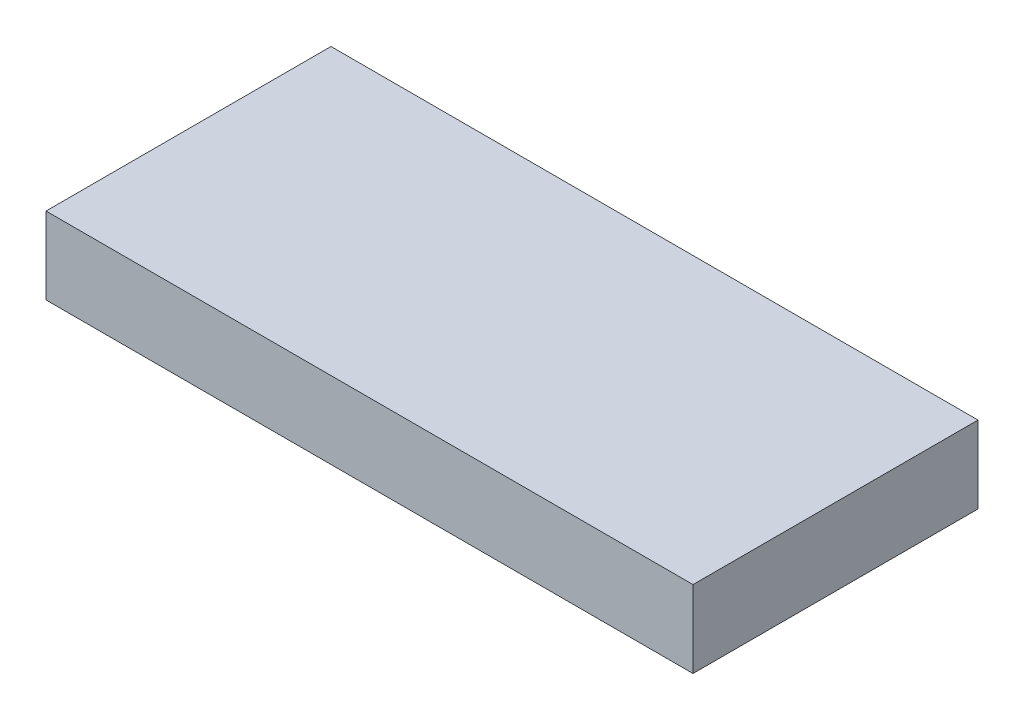
ISO-10303-21;
HEADER;
FILE_DESCRIPTION(('STEP AP214'),'2;1');
FILE_NAME('part.step','',(''),(''),'','','');
FILE_SCHEMA(('AUTOMOTIVE_DESIGN { 1 0 10303 214 1 1 1 1 }'));
ENDSEC;
DATA;
#1=APPLICATION_CONTEXT('core data for automotive mechanical design processes');
#2=APPLICATION_PROTOCOL_DEFINITION('international standard','automotive_design',2000,#1);
#3=PRODUCT_CONTEXT('',#1,'mechanical');
#4=PRODUCT('Part','Part','',(#3));
#5=PRODUCT_RELATED_PRODUCT_CATEGORY('part','',(#4));
#6=PRODUCT_DEFINITION_FORMATION('','',#4);
#7=PRODUCT_DEFINITION_CONTEXT('part definition',#1,'design');
#8=PRODUCT_DEFINITION('design','',#6,#7);
#9=PRODUCT_DEFINITION_SHAPE('','',#8);
#10=(LENGTH_UNIT() NAMED_UNIT(*) SI_UNIT(.MILLI.,.METRE.));
#11=(NAMED_UNIT(*) PLANE_ANGLE_UNIT() SI_UNIT($,.RADIAN.));
#12=(NAMED_UNIT(*) SI_UNIT($,.STERADIAN.) SOLID_ANGLE_UNIT());
#13=UNCERTAINTY_MEASURE_WITH_UNIT(LENGTH_MEASURE(1.E-05),#10,'distance_accuracy_value','');
#14=(GEOMETRIC_REPRESENTATION_CONTEXT(3) GLOBAL_UNCERTAINTY_ASSIGNED_CONTEXT((#13)) GLOBAL_UNIT_ASSIGNED_CONTEXT((#10,
#11,#12)) REPRESENTATION_CONTEXT('',''));
#15=CARTESIAN_POINT('',(0.,0.,0.));
#16=DIRECTION('',(0.,0.,1.));
#17=DIRECTION('',(1.,0.,0.));
#18=AXIS2_PLACEMENT_3D('',#15,#16,#17);
#19=CARTESIAN_POINT('',(0.,5.,0.));
#20=DIRECTION('',(1.,0.,0.));
#21=DIRECTION('',(0.,0.,-1.));
#22=AXIS2_PLACEMENT_3D('',#19,#20,#21);
#23=PLANE('',#22);
#24=DIRECTION('',(0.,0.,1.));
#25=VECTOR('',#24,1.);
#26=CARTESIAN_POINT('',(0.,0.,0.));
#27=LINE('',#26,#25);
#28=CARTESIAN_POINT('',(0.,0.,-18.5));
#29=VERTEX_POINT('',#28);
#30=CARTESIAN_POINT('',(0.,0.,0.));
#31=VERTEX_POINT('',#30);
#32=EDGE_CURVE('E107',#29,#31,#27,.T.);
#33=ORIENTED_EDGE('',*,*,#32,.T.);
#34=DIRECTION('',(0.,-1.,0.));
#35=VECTOR('',#34,1.);
#36=CARTESIAN_POINT('',(0.,5.,0.));
#37=LINE('',#36,#35);
#38=CARTESIAN_POINT('',(0.,5.,0.));
#39=VERTEX_POINT('',#38);
#40=EDGE_CURVE('E11',#39,#31,#37,.T.);
#41=ORIENTED_EDGE('',*,*,#40,.F.);
#42=DIRECTION('',(0.,0.,1.));
#43=VECTOR('',#42,1.);
#44=CARTESIAN_POINT('',(0.,5.,0.));
#45=LINE('',#44,#43);
#46=CARTESIAN_POINT('',(0.,5.,-18.5));
#47=VERTEX_POINT('',#46);
#48=EDGE_CURVE('E91',#47,#39,#45,.T.);
#49=ORIENTED_EDGE('',*,*,#48,.F.);
#50=DIRECTION('',(0.,-1.,0.));
#51=VECTOR('',#50,1.);
#52=CARTESIAN_POINT('',(0.,5.,-18.5));
#53=LINE('',#52,#51);
#54=EDGE_CURVE('E103',#47,#29,#53,.T.);
#55=ORIENTED_EDGE('',*,*,#54,.T.);
#56=EDGE_LOOP('',(#33,#41,#49,#55));
#57=FACE_BOUND('',#56,.T.);
#58=ADVANCED_FACE('F39',(#57),#23,.F.);
#59=CARTESIAN_POINT('',(0.,5.,0.));
#60=DIRECTION('',(0.,0.,-1.));
#61=DIRECTION('',(-1.,0.,0.));
#62=AXIS2_PLACEMENT_3D('',#59,#60,#61);
#63=PLANE('',#62);
#64=DIRECTION('',(1.,0.,0.));
#65=VECTOR('',#64,1.);
#66=CARTESIAN_POINT('',(0.,0.,0.));
#67=LINE('',#66,#65);
#68=CARTESIAN_POINT('',(42.,0.,0.));
#69=VERTEX_POINT('',#68);
#70=EDGE_CURVE('E96',#31,#69,#67,.T.);
#71=ORIENTED_EDGE('',*,*,#70,.T.);
#72=DIRECTION('',(0.,-1.,0.));
#73=VECTOR('',#72,1.);
#74=CARTESIAN_POINT('',(42.,5.,0.));
#75=LINE('',#74,#73);
#76=CARTESIAN_POINT('',(42.,5.,0.));
#77=VERTEX_POINT('',#76);
#78=EDGE_CURVE('E48',#77,#69,#75,.T.);
#79=ORIENTED_EDGE('',*,*,#78,.F.);
#80=DIRECTION('',(1.,0.,0.));
#81=VECTOR('',#80,1.);
#82=CARTESIAN_POINT('',(0.,5.,0.));
#83=LINE('',#82,#81);
#84=EDGE_CURVE('E86',#39,#77,#83,.T.);
#85=ORIENTED_EDGE('',*,*,#84,.F.);
#86=ORIENTED_EDGE('',*,*,#40,.T.);
#87=EDGE_LOOP('',(#71,#79,#85,#86));
#88=FACE_BOUND('',#87,.T.);
#89=ADVANCED_FACE('F95',(#88),#63,.F.);
#90=CARTESIAN_POINT('',(42.,5.,0.));
#91=DIRECTION('',(-1.,0.,0.));
#92=DIRECTION('',(0.,0.,1.));
#93=AXIS2_PLACEMENT_3D('',#90,#91,#92);
#94=PLANE('',#93);
#95=DIRECTION('',(0.,0.,-1.));
#96=VECTOR('',#95,1.);
#97=CARTESIAN_POINT('',(42.,0.,0.));
#98=LINE('',#97,#96);
#99=CARTESIAN_POINT('',(42.,0.,-18.5));
#100=VERTEX_POINT('',#99);
#101=EDGE_CURVE('E73',#69,#100,#98,.T.);
#102=ORIENTED_EDGE('',*,*,#101,.T.);
#103=DIRECTION('',(0.,-1.,0.));
#104=VECTOR('',#103,1.);
#105=CARTESIAN_POINT('',(42.,5.,-18.5));
#106=LINE('',#105,#104);
#107=CARTESIAN_POINT('',(42.,5.,-18.5));
#108=VERTEX_POINT('',#107);
#109=EDGE_CURVE('E98',#108,#100,#106,.T.);
#110=ORIENTED_EDGE('',*,*,#109,.F.);
#111=DIRECTION('',(0.,0.,-1.));
#112=VECTOR('',#111,1.);
#113=CARTESIAN_POINT('',(42.,5.,0.));
#114=LINE('',#113,#112);
#115=EDGE_CURVE('E89',#77,#108,#114,.T.);
#116=ORIENTED_EDGE('',*,*,#115,.F.);
#117=ORIENTED_EDGE('',*,*,#78,.T.);
#118=EDGE_LOOP('',(#102,#110,#116,#117));
#119=FACE_BOUND('',#118,.T.);
#120=ADVANCED_FACE('F99',(#119),#94,.F.);
#121=CARTESIAN_POINT('',(0.,5.,-18.5));
#122=DIRECTION('',(0.,0.,1.));
#123=DIRECTION('',(1.,0.,0.));
#124=AXIS2_PLACEMENT_3D('',#121,#122,#123);
#125=PLANE('',#124);
#126=DIRECTION('',(-1.,0.,0.));
#127=VECTOR('',#126,1.);
#128=CARTESIAN_POINT('',(0.,0.,-18.5));
#129=LINE('',#128,#127);
#130=EDGE_CURVE('E79',#100,#29,#129,.T.);
#131=ORIENTED_EDGE('',*,*,#130,.T.);
#132=ORIENTED_EDGE('',*,*,#54,.F.);
#133=DIRECTION('',(-1.,0.,0.));
#134=VECTOR('',#133,1.);
#135=CARTESIAN_POINT('',(0.,5.,-18.5));
#136=LINE('',#135,#134);
#137=EDGE_CURVE('E56',#108,#47,#136,.T.);
#138=ORIENTED_EDGE('',*,*,#137,.F.);
#139=ORIENTED_EDGE('',*,*,#109,.T.);
#140=EDGE_LOOP('',(#131,#132,#138,#139));
#141=FACE_BOUND('',#140,.T.);
#142=ADVANCED_FACE('F120',(#141),#125,.F.);
#143=CARTESIAN_POINT('',(0.,5.,0.));
#144=DIRECTION('',(0.,-1.,0.));
#145=DIRECTION('',(0.,0.,-1.));
#146=AXIS2_PLACEMENT_3D('',#143,#144,#145);
#147=PLANE('',#146);
#148=ORIENTED_EDGE('',*,*,#48,.T.);
#149=ORIENTED_EDGE('',*,*,#84,.T.);
#150=ORIENTED_EDGE('',*,*,#115,.T.);
#151=ORIENTED_EDGE('',*,*,#137,.T.);
#152=EDGE_LOOP('',(#148,#149,#150,#151));
#153=FACE_BOUND('',#152,.T.);
#154=ADVANCED_FACE('F87',(#153),#147,.F.);
#155=CARTESIAN_POINT('',(0.,0.,0.));
#156=DIRECTION('',(0.,-1.,0.));
#157=DIRECTION('',(0.,0.,-1.));
#158=AXIS2_PLACEMENT_3D('',#155,#156,#157);
#159=PLANE('',#158);
#160=ORIENTED_EDGE('',*,*,#32,.F.);
#161=ORIENTED_EDGE('',*,*,#130,.F.);
#162=ORIENTED_EDGE('',*,*,#101,.F.);
#163=ORIENTED_EDGE('',*,*,#70,.F.);
#164=EDGE_LOOP('',(#160,#161,#162,#163));
#165=FACE_BOUND('',#164,.T.);
#166=ADVANCED_FACE('F123',(#165),#159,.T.);
#167=CLOSED_SHELL('',(#58,#89,#120,#142,#154,#166));
#168=MANIFOLD_SOLID_BREP('B2',#167);
#169=ADVANCED_BREP_SHAPE_REPRESENTATION('',(#18,#168),#14);
#170=SHAPE_DEFINITION_REPRESENTATION(#9,#169);
ENDSEC;
END-ISO-10303-21;
